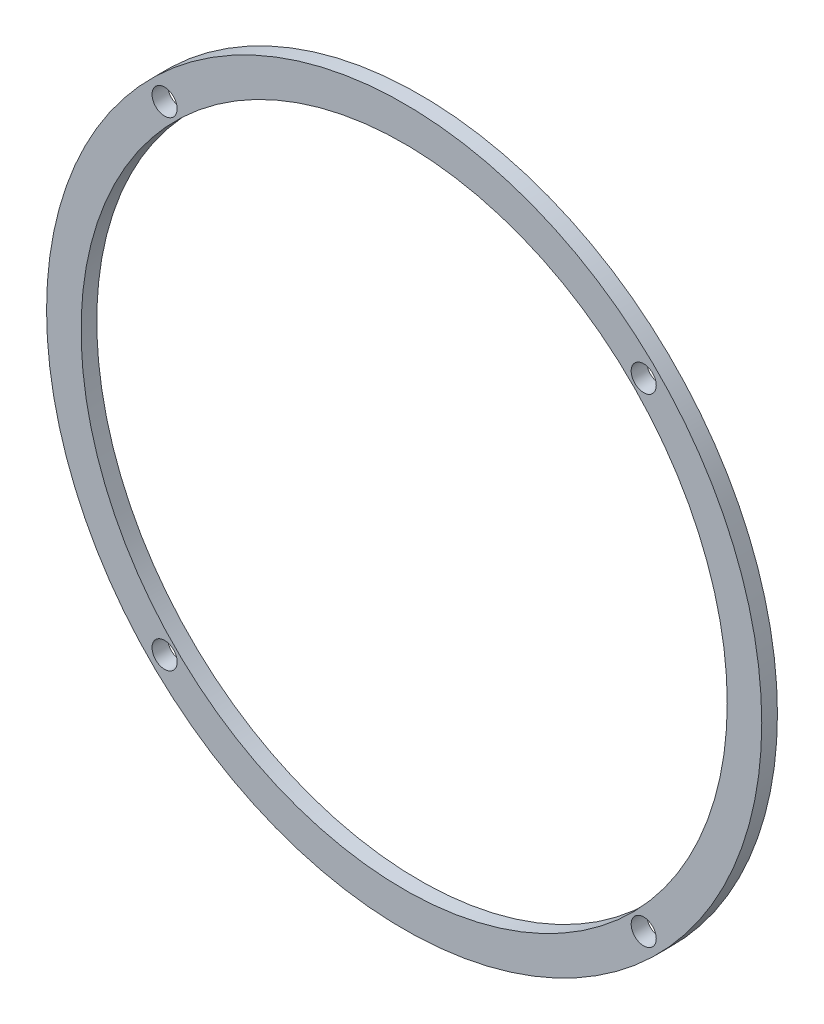
ISO-10303-21;
HEADER;
FILE_DESCRIPTION(('STEP AP214'),'2;1');
FILE_NAME('part.step','',(''),(''),'','','');
FILE_SCHEMA(('AUTOMOTIVE_DESIGN { 1 0 10303 214 1 1 1 1 }'));
ENDSEC;
DATA;
#1=APPLICATION_CONTEXT('core data for automotive mechanical design processes');
#2=APPLICATION_PROTOCOL_DEFINITION('international standard','automotive_design',2000,#1);
#3=PRODUCT_CONTEXT('',#1,'mechanical');
#4=PRODUCT('Part','Part','',(#3));
#5=PRODUCT_RELATED_PRODUCT_CATEGORY('part','',(#4));
#6=PRODUCT_DEFINITION_FORMATION('','',#4);
#7=PRODUCT_DEFINITION_CONTEXT('part definition',#1,'design');
#8=PRODUCT_DEFINITION('design','',#6,#7);
#9=PRODUCT_DEFINITION_SHAPE('','',#8);
#10=(LENGTH_UNIT() NAMED_UNIT(*) SI_UNIT(.MILLI.,.METRE.));
#11=(NAMED_UNIT(*) PLANE_ANGLE_UNIT() SI_UNIT($,.RADIAN.));
#12=(NAMED_UNIT(*) SI_UNIT($,.STERADIAN.) SOLID_ANGLE_UNIT());
#13=UNCERTAINTY_MEASURE_WITH_UNIT(LENGTH_MEASURE(1.E-05),#10,'distance_accuracy_value','');
#14=(GEOMETRIC_REPRESENTATION_CONTEXT(3) GLOBAL_UNCERTAINTY_ASSIGNED_CONTEXT((#13)) GLOBAL_UNIT_ASSIGNED_CONTEXT((#10,
#11,#12)) REPRESENTATION_CONTEXT('',''));
#15=CARTESIAN_POINT('',(0.,0.,0.));
#16=DIRECTION('',(0.,0.,1.));
#17=DIRECTION('',(1.,0.,0.));
#18=AXIS2_PLACEMENT_3D('',#15,#16,#17);
#19=CARTESIAN_POINT('',(-0.0885959557702445,-0.11645091693642,2.5));
#20=DIRECTION('',(0.,0.,1.));
#21=DIRECTION('',(1.,0.,0.));
#22=AXIS2_PLACEMENT_3D('',#19,#20,#21);
#23=PLANE('',#22);
#24=CARTESIAN_POINT('',(38.0951702283033,-38.30021710101,2.5));
#25=DIRECTION('',(0.,0.,1.));
#26=DIRECTION('',(1.,0.,0.));
#27=AXIS2_PLACEMENT_3D('',#24,#25,#26);
#28=CIRCLE('',#27,2.00000000000064);
#29=CARTESIAN_POINT('',(40.095170228304,-38.30021710101,2.5));
#30=VERTEX_POINT('',#29);
#31=EDGE_CURVE('E59',#30,#30,#28,.T.);
#32=ORIENTED_EDGE('',*,*,#31,.F.);
#33=EDGE_LOOP('',(#32));
#34=FACE_BOUND('',#33,.T.);
#35=CARTESIAN_POINT('',(-38.2723621398438,38.0673152671371,2.5));
#36=DIRECTION('',(0.,0.,1.));
#37=DIRECTION('',(1.,0.,0.));
#38=AXIS2_PLACEMENT_3D('',#35,#36,#37);
#39=CIRCLE('',#38,1.99999999999787);
#40=CARTESIAN_POINT('',(-36.2723621398459,38.0673152671371,2.5));
#41=VERTEX_POINT('',#40);
#42=EDGE_CURVE('E47',#41,#41,#39,.T.);
#43=ORIENTED_EDGE('',*,*,#42,.F.);
#44=EDGE_LOOP('',(#43));
#45=FACE_BOUND('',#44,.T.);
#46=CARTESIAN_POINT('',(-0.0885959557702445,-0.11645091693642,2.5));
#47=DIRECTION('',(0.,0.,1.));
#48=DIRECTION('',(1.,0.,0.));
#49=AXIS2_PLACEMENT_3D('',#46,#47,#48);
#50=CIRCLE('',#49,57.);
#51=CARTESIAN_POINT('',(56.9114040442298,-0.11645091693642,2.5));
#52=VERTEX_POINT('',#51);
#53=EDGE_CURVE('E10',#52,#52,#50,.T.);
#54=ORIENTED_EDGE('',*,*,#53,.T.);
#55=EDGE_LOOP('',(#54));
#56=FACE_BOUND('',#55,.T.);
#57=CARTESIAN_POINT('',(-0.0885959557702445,-0.11645091693642,2.5));
#58=DIRECTION('',(0.,0.,1.));
#59=DIRECTION('',(1.,0.,0.));
#60=AXIS2_PLACEMENT_3D('',#57,#58,#59);
#61=CIRCLE('',#60,51.5);
#62=CARTESIAN_POINT('',(51.4114040442298,-0.11645091693642,2.5));
#63=VERTEX_POINT('',#62);
#64=EDGE_CURVE('E42',#63,#63,#61,.T.);
#65=ORIENTED_EDGE('',*,*,#64,.F.);
#66=EDGE_LOOP('',(#65));
#67=FACE_BOUND('',#66,.T.);
#68=CARTESIAN_POINT('',(38.0951702283033,38.0673152671371,2.5));
#69=DIRECTION('',(0.,0.,1.));
#70=DIRECTION('',(1.,0.,0.));
#71=AXIS2_PLACEMENT_3D('',#68,#69,#70);
#72=CIRCLE('',#71,1.99999999999851);
#73=CARTESIAN_POINT('',(40.0951702283018,38.0673152671371,2.5));
#74=VERTEX_POINT('',#73);
#75=EDGE_CURVE('E53',#74,#74,#72,.T.);
#76=ORIENTED_EDGE('',*,*,#75,.F.);
#77=EDGE_LOOP('',(#76));
#78=FACE_BOUND('',#77,.T.);
#79=CARTESIAN_POINT('',(-38.2723621398438,-38.30021710101,2.5));
#80=DIRECTION('',(0.,0.,1.));
#81=DIRECTION('',(1.,0.,0.));
#82=AXIS2_PLACEMENT_3D('',#79,#80,#81);
#83=CIRCLE('',#82,2.);
#84=CARTESIAN_POINT('',(-36.2723621398438,-38.30021710101,2.5));
#85=VERTEX_POINT('',#84);
#86=EDGE_CURVE('E65',#85,#85,#83,.T.);
#87=ORIENTED_EDGE('',*,*,#86,.F.);
#88=EDGE_LOOP('',(#87));
#89=FACE_BOUND('',#88,.T.);
#90=ADVANCED_FACE('F31',(#34,#45,#56,#67,#78,#89),#23,.T.);
#91=CARTESIAN_POINT('',(-0.0885959557702445,-0.11645091693642,0.));
#92=DIRECTION('',(0.,0.,1.));
#93=DIRECTION('',(1.,0.,0.));
#94=AXIS2_PLACEMENT_3D('',#91,#92,#93);
#95=PLANE('',#94);
#96=CARTESIAN_POINT('',(-0.0885959557702445,-0.11645091693642,0.));
#97=DIRECTION('',(0.,0.,1.));
#98=DIRECTION('',(1.,0.,0.));
#99=AXIS2_PLACEMENT_3D('',#96,#97,#98);
#100=CIRCLE('',#99,57.);
#101=CARTESIAN_POINT('',(56.9114040442298,-0.11645091693642,0.));
#102=VERTEX_POINT('',#101);
#103=EDGE_CURVE('E35',#102,#102,#100,.T.);
#104=ORIENTED_EDGE('',*,*,#103,.F.);
#105=EDGE_LOOP('',(#104));
#106=FACE_BOUND('',#105,.T.);
#107=CARTESIAN_POINT('',(-0.0885959557702445,-0.11645091693642,0.));
#108=DIRECTION('',(0.,0.,1.));
#109=DIRECTION('',(1.,0.,0.));
#110=AXIS2_PLACEMENT_3D('',#107,#108,#109);
#111=CIRCLE('',#110,51.5);
#112=CARTESIAN_POINT('',(51.4114040442298,-0.11645091693642,0.));
#113=VERTEX_POINT('',#112);
#114=EDGE_CURVE('E44',#113,#113,#111,.T.);
#115=ORIENTED_EDGE('',*,*,#114,.T.);
#116=EDGE_LOOP('',(#115));
#117=FACE_BOUND('',#116,.T.);
#118=CARTESIAN_POINT('',(-38.2723621398438,38.0673152671371,0.));
#119=DIRECTION('',(0.,0.,1.));
#120=DIRECTION('',(1.,0.,0.));
#121=AXIS2_PLACEMENT_3D('',#118,#119,#120);
#122=CIRCLE('',#121,1.99999999999787);
#123=CARTESIAN_POINT('',(-36.2723621398459,38.0673152671371,0.));
#124=VERTEX_POINT('',#123);
#125=EDGE_CURVE('E50',#124,#124,#122,.T.);
#126=ORIENTED_EDGE('',*,*,#125,.T.);
#127=EDGE_LOOP('',(#126));
#128=FACE_BOUND('',#127,.T.);
#129=CARTESIAN_POINT('',(38.0951702283033,38.0673152671371,0.));
#130=DIRECTION('',(0.,0.,1.));
#131=DIRECTION('',(1.,0.,0.));
#132=AXIS2_PLACEMENT_3D('',#129,#130,#131);
#133=CIRCLE('',#132,1.99999999999851);
#134=CARTESIAN_POINT('',(40.0951702283018,38.0673152671371,0.));
#135=VERTEX_POINT('',#134);
#136=EDGE_CURVE('E56',#135,#135,#133,.T.);
#137=ORIENTED_EDGE('',*,*,#136,.T.);
#138=EDGE_LOOP('',(#137));
#139=FACE_BOUND('',#138,.T.);
#140=CARTESIAN_POINT('',(38.0951702283033,-38.30021710101,0.));
#141=DIRECTION('',(0.,0.,1.));
#142=DIRECTION('',(1.,0.,0.));
#143=AXIS2_PLACEMENT_3D('',#140,#141,#142);
#144=CIRCLE('',#143,2.00000000000064);
#145=CARTESIAN_POINT('',(40.095170228304,-38.30021710101,0.));
#146=VERTEX_POINT('',#145);
#147=EDGE_CURVE('E62',#146,#146,#144,.T.);
#148=ORIENTED_EDGE('',*,*,#147,.T.);
#149=EDGE_LOOP('',(#148));
#150=FACE_BOUND('',#149,.T.);
#151=CARTESIAN_POINT('',(-38.2723621398438,-38.30021710101,0.));
#152=DIRECTION('',(0.,0.,1.));
#153=DIRECTION('',(1.,0.,0.));
#154=AXIS2_PLACEMENT_3D('',#151,#152,#153);
#155=CIRCLE('',#154,2.);
#156=CARTESIAN_POINT('',(-36.2723621398438,-38.30021710101,0.));
#157=VERTEX_POINT('',#156);
#158=EDGE_CURVE('E68',#157,#157,#155,.T.);
#159=ORIENTED_EDGE('',*,*,#158,.T.);
#160=EDGE_LOOP('',(#159));
#161=FACE_BOUND('',#160,.T.);
#162=ADVANCED_FACE('F78',(#106,#117,#128,#139,#150,#161),#95,.F.);
#163=CARTESIAN_POINT('',(-0.0885959557702445,-0.11645091693642,2.5));
#164=DIRECTION('',(0.,0.,-1.));
#165=DIRECTION('',(-1.,0.,0.));
#166=AXIS2_PLACEMENT_3D('',#163,#164,#165);
#167=CYLINDRICAL_SURFACE('',#166,57.);
#168=ORIENTED_EDGE('',*,*,#53,.F.);
#169=EDGE_LOOP('',(#168));
#170=FACE_BOUND('',#169,.T.);
#171=ORIENTED_EDGE('',*,*,#103,.T.);
#172=EDGE_LOOP('',(#171));
#173=FACE_BOUND('',#172,.T.);
#174=ADVANCED_FACE('F33',(#170,#173),#167,.T.);
#175=CARTESIAN_POINT('',(-0.0885959557702445,-0.11645091693642,2.5));
#176=DIRECTION('',(0.,0.,-1.));
#177=DIRECTION('',(-1.,0.,0.));
#178=AXIS2_PLACEMENT_3D('',#175,#176,#177);
#179=CYLINDRICAL_SURFACE('',#178,51.5);
#180=ORIENTED_EDGE('',*,*,#64,.T.);
#181=EDGE_LOOP('',(#180));
#182=FACE_BOUND('',#181,.T.);
#183=ORIENTED_EDGE('',*,*,#114,.F.);
#184=EDGE_LOOP('',(#183));
#185=FACE_BOUND('',#184,.T.);
#186=ADVANCED_FACE('F88',(#182,#185),#179,.F.);
#187=CARTESIAN_POINT('',(-38.2723621398438,38.0673152671371,2.5));
#188=DIRECTION('',(0.,0.,-1.));
#189=DIRECTION('',(-1.,0.,0.));
#190=AXIS2_PLACEMENT_3D('',#187,#188,#189);
#191=CYLINDRICAL_SURFACE('',#190,1.99999999999787);
#192=ORIENTED_EDGE('',*,*,#42,.T.);
#193=EDGE_LOOP('',(#192));
#194=FACE_BOUND('',#193,.T.);
#195=ORIENTED_EDGE('',*,*,#125,.F.);
#196=EDGE_LOOP('',(#195));
#197=FACE_BOUND('',#196,.T.);
#198=ADVANCED_FACE('F91',(#194,#197),#191,.F.);
#199=CARTESIAN_POINT('',(38.0951702283033,38.0673152671371,2.5));
#200=DIRECTION('',(0.,0.,-1.));
#201=DIRECTION('',(-1.,0.,0.));
#202=AXIS2_PLACEMENT_3D('',#199,#200,#201);
#203=CYLINDRICAL_SURFACE('',#202,1.99999999999851);
#204=ORIENTED_EDGE('',*,*,#75,.T.);
#205=EDGE_LOOP('',(#204));
#206=FACE_BOUND('',#205,.T.);
#207=ORIENTED_EDGE('',*,*,#136,.F.);
#208=EDGE_LOOP('',(#207));
#209=FACE_BOUND('',#208,.T.);
#210=ADVANCED_FACE('F95',(#206,#209),#203,.F.);
#211=CARTESIAN_POINT('',(38.0951702283033,-38.30021710101,2.5));
#212=DIRECTION('',(0.,0.,-1.));
#213=DIRECTION('',(-1.,0.,0.));
#214=AXIS2_PLACEMENT_3D('',#211,#212,#213);
#215=CYLINDRICAL_SURFACE('',#214,2.00000000000064);
#216=ORIENTED_EDGE('',*,*,#31,.T.);
#217=EDGE_LOOP('',(#216));
#218=FACE_BOUND('',#217,.T.);
#219=ORIENTED_EDGE('',*,*,#147,.F.);
#220=EDGE_LOOP('',(#219));
#221=FACE_BOUND('',#220,.T.);
#222=ADVANCED_FACE('F99',(#218,#221),#215,.F.);
#223=CARTESIAN_POINT('',(-38.2723621398438,-38.30021710101,2.5));
#224=DIRECTION('',(0.,0.,-1.));
#225=DIRECTION('',(-1.,0.,0.));
#226=AXIS2_PLACEMENT_3D('',#223,#224,#225);
#227=CYLINDRICAL_SURFACE('',#226,2.);
#228=ORIENTED_EDGE('',*,*,#86,.T.);
#229=EDGE_LOOP('',(#228));
#230=FACE_BOUND('',#229,.T.);
#231=ORIENTED_EDGE('',*,*,#158,.F.);
#232=EDGE_LOOP('',(#231));
#233=FACE_BOUND('',#232,.T.);
#234=ADVANCED_FACE('F74',(#230,#233),#227,.F.);
#235=CLOSED_SHELL('',(#90,#162,#174,#186,#198,#210,#222,#234));
#236=MANIFOLD_SOLID_BREP('B2',#235);
#237=ADVANCED_BREP_SHAPE_REPRESENTATION('',(#18,#236),#14);
#238=SHAPE_DEFINITION_REPRESENTATION(#9,#237);
ENDSEC;
END-ISO-10303-21;
